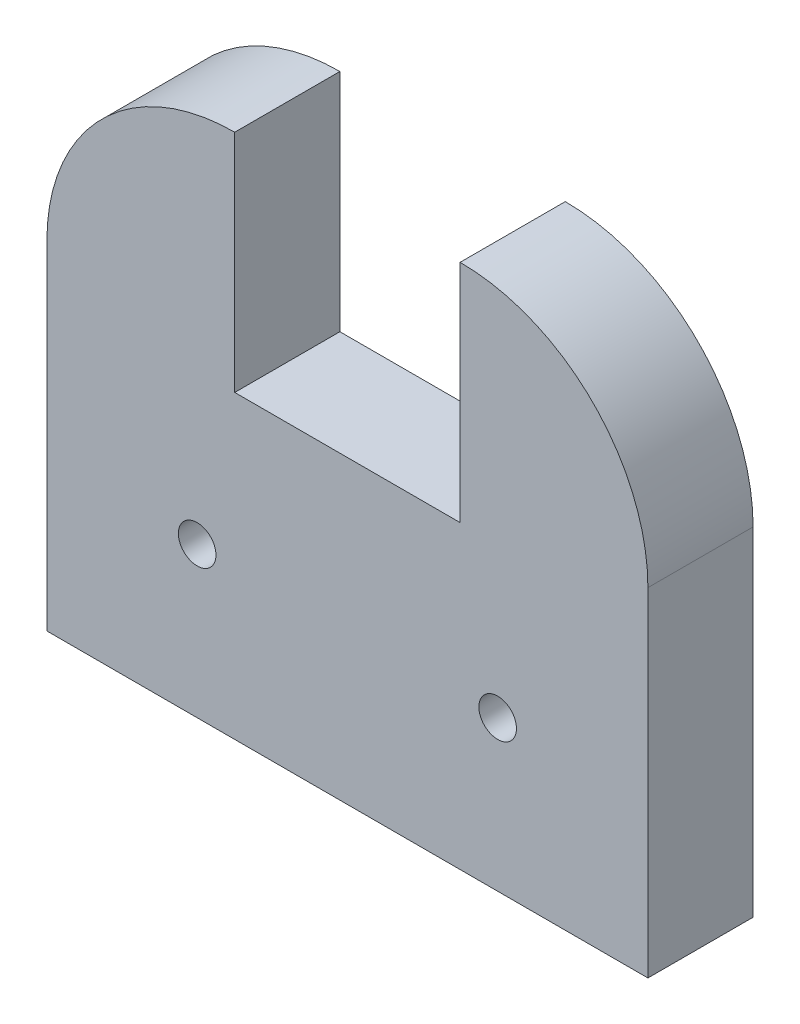
ISO-10303-21;
HEADER;
FILE_DESCRIPTION(('STEP AP214'),'2;1');
FILE_NAME('part.step','',(''),(''),'','','');
FILE_SCHEMA(('AUTOMOTIVE_DESIGN { 1 0 10303 214 1 1 1 1 }'));
ENDSEC;
DATA;
#1=APPLICATION_CONTEXT('core data for automotive mechanical design processes');
#2=APPLICATION_PROTOCOL_DEFINITION('international standard','automotive_design',2000,#1);
#3=PRODUCT_CONTEXT('',#1,'mechanical');
#4=PRODUCT('Part','Part','',(#3));
#5=PRODUCT_RELATED_PRODUCT_CATEGORY('part','',(#4));
#6=PRODUCT_DEFINITION_FORMATION('','',#4);
#7=PRODUCT_DEFINITION_CONTEXT('part definition',#1,'design');
#8=PRODUCT_DEFINITION('design','',#6,#7);
#9=PRODUCT_DEFINITION_SHAPE('','',#8);
#10=(LENGTH_UNIT() NAMED_UNIT(*) SI_UNIT(.MILLI.,.METRE.));
#11=(NAMED_UNIT(*) PLANE_ANGLE_UNIT() SI_UNIT($,.RADIAN.));
#12=(NAMED_UNIT(*) SI_UNIT($,.STERADIAN.) SOLID_ANGLE_UNIT());
#13=UNCERTAINTY_MEASURE_WITH_UNIT(LENGTH_MEASURE(1.E-05),#10,'distance_accuracy_value','');
#14=(GEOMETRIC_REPRESENTATION_CONTEXT(3) GLOBAL_UNCERTAINTY_ASSIGNED_CONTEXT((#13)) GLOBAL_UNIT_ASSIGNED_CONTEXT((#10,
#11,#12)) REPRESENTATION_CONTEXT('',''));
#15=CARTESIAN_POINT('',(0.,0.,0.));
#16=DIRECTION('',(0.,0.,1.));
#17=DIRECTION('',(1.,0.,0.));
#18=AXIS2_PLACEMENT_3D('',#15,#16,#17);
#19=CARTESIAN_POINT('',(-45.8724694390817,52.0606367004635,17.78));
#20=DIRECTION('',(1.,0.,0.));
#21=DIRECTION('',(0.,1.,0.));
#22=AXIS2_PLACEMENT_3D('',#19,#20,#21);
#23=PLANE('',#22);
#24=DIRECTION('',(0.,-1.,0.));
#25=VECTOR('',#24,1.);
#26=CARTESIAN_POINT('',(-45.8724694390817,52.0606367004635,17.78));
#27=LINE('',#26,#25);
#28=CARTESIAN_POINT('',(-45.8724694390817,20.3106367004635,17.78));
#29=VERTEX_POINT('',#28);
#30=CARTESIAN_POINT('',(-45.8724694390817,-36.8393632995365,17.78));
#31=VERTEX_POINT('',#30);
#32=EDGE_CURVE('E145',#29,#31,#27,.T.);
#33=ORIENTED_EDGE('',*,*,#32,.F.);
#34=DIRECTION('',(0.,0.,-1.));
#35=VECTOR('',#34,1.);
#36=CARTESIAN_POINT('',(-45.8724694390817,20.3106367004635,17.78));
#37=LINE('',#36,#35);
#38=CARTESIAN_POINT('',(-45.8724694390817,20.3106367004635,0.));
#39=VERTEX_POINT('',#38);
#40=EDGE_CURVE('E11',#29,#39,#37,.T.);
#41=ORIENTED_EDGE('',*,*,#40,.T.);
#42=DIRECTION('',(0.,-1.,0.));
#43=VECTOR('',#42,1.);
#44=CARTESIAN_POINT('',(-45.8724694390817,52.0606367004635,0.));
#45=LINE('',#44,#43);
#46=CARTESIAN_POINT('',(-45.8724694390817,-36.8393632995365,0.));
#47=VERTEX_POINT('',#46);
#48=EDGE_CURVE('E142',#39,#47,#45,.T.);
#49=ORIENTED_EDGE('',*,*,#48,.T.);
#50=DIRECTION('',(0.,0.,-1.));
#51=VECTOR('',#50,1.);
#52=CARTESIAN_POINT('',(-45.8724694390817,-36.8393632995365,17.78));
#53=LINE('',#52,#51);
#54=EDGE_CURVE('E159',#31,#47,#53,.T.);
#55=ORIENTED_EDGE('',*,*,#54,.F.);
#56=EDGE_LOOP('',(#33,#41,#49,#55));
#57=FACE_BOUND('',#56,.T.);
#58=ADVANCED_FACE('F31',(#57),#23,.F.);
#59=CARTESIAN_POINT('',(-45.8724694390817,-36.8393632995365,17.78));
#60=DIRECTION('',(0.,1.,0.));
#61=DIRECTION('',(0.,0.,1.));
#62=AXIS2_PLACEMENT_3D('',#59,#60,#61);
#63=PLANE('',#62);
#64=DIRECTION('',(1.,0.,0.));
#65=VECTOR('',#64,1.);
#66=CARTESIAN_POINT('',(-45.8724694390817,-36.8393632995365,0.));
#67=LINE('',#66,#65);
#68=CARTESIAN_POINT('',(55.7275305609183,-36.8393632995365,0.));
#69=VERTEX_POINT('',#68);
#70=EDGE_CURVE('E154',#47,#69,#67,.T.);
#71=ORIENTED_EDGE('',*,*,#70,.T.);
#72=DIRECTION('',(0.,0.,-1.));
#73=VECTOR('',#72,1.);
#74=CARTESIAN_POINT('',(55.7275305609183,-36.8393632995365,17.78));
#75=LINE('',#74,#73);
#76=CARTESIAN_POINT('',(55.7275305609183,-36.8393632995365,17.78));
#77=VERTEX_POINT('',#76);
#78=EDGE_CURVE('E152',#77,#69,#75,.T.);
#79=ORIENTED_EDGE('',*,*,#78,.F.);
#80=DIRECTION('',(1.,0.,0.));
#81=VECTOR('',#80,1.);
#82=CARTESIAN_POINT('',(-45.8724694390817,-36.8393632995365,17.78));
#83=LINE('',#82,#81);
#84=EDGE_CURVE('E147',#31,#77,#83,.T.);
#85=ORIENTED_EDGE('',*,*,#84,.F.);
#86=ORIENTED_EDGE('',*,*,#54,.T.);
#87=EDGE_LOOP('',(#71,#79,#85,#86));
#88=FACE_BOUND('',#87,.T.);
#89=ADVANCED_FACE('F187',(#88),#63,.F.);
#90=CARTESIAN_POINT('',(55.7275305609183,52.0606367004635,17.78));
#91=DIRECTION('',(-1.,0.,0.));
#92=DIRECTION('',(0.,-1.,0.));
#93=AXIS2_PLACEMENT_3D('',#90,#91,#92);
#94=PLANE('',#93);
#95=DIRECTION('',(0.,1.,0.));
#96=VECTOR('',#95,1.);
#97=CARTESIAN_POINT('',(55.7275305609183,52.0606367004635,0.));
#98=LINE('',#97,#96);
#99=CARTESIAN_POINT('',(55.7275305609183,20.3106367004635,0.));
#100=VERTEX_POINT('',#99);
#101=EDGE_CURVE('E148',#69,#100,#98,.T.);
#102=ORIENTED_EDGE('',*,*,#101,.T.);
#103=DIRECTION('',(0.,0.,-1.));
#104=VECTOR('',#103,1.);
#105=CARTESIAN_POINT('',(55.7275305609183,20.3106367004635,17.78));
#106=LINE('',#105,#104);
#107=CARTESIAN_POINT('',(55.7275305609183,20.3106367004635,17.78));
#108=VERTEX_POINT('',#107);
#109=EDGE_CURVE('E54',#100,#108,#106,.F.);
#110=ORIENTED_EDGE('',*,*,#109,.T.);
#111=DIRECTION('',(0.,1.,0.));
#112=VECTOR('',#111,1.);
#113=CARTESIAN_POINT('',(55.7275305609183,52.0606367004635,17.78));
#114=LINE('',#113,#112);
#115=EDGE_CURVE('E150',#77,#108,#114,.T.);
#116=ORIENTED_EDGE('',*,*,#115,.F.);
#117=ORIENTED_EDGE('',*,*,#78,.T.);
#118=EDGE_LOOP('',(#102,#110,#116,#117));
#119=FACE_BOUND('',#118,.T.);
#120=ADVANCED_FACE('F183',(#119),#94,.F.);
#121=CARTESIAN_POINT('',(-45.8724694390817,-36.8393632995365,17.78));
#122=DIRECTION('',(0.,0.,1.));
#123=DIRECTION('',(1.,0.,0.));
#124=AXIS2_PLACEMENT_3D('',#121,#122,#123);
#125=PLANE('',#124);
#126=DIRECTION('',(0.,-1.,0.));
#127=VECTOR('',#126,1.);
#128=CARTESIAN_POINT('',(-14.1224694390817,52.0606367004635,17.78));
#129=LINE('',#128,#127);
#130=CARTESIAN_POINT('',(-14.1224694390817,52.0606367004635,17.78));
#131=VERTEX_POINT('',#130);
#132=CARTESIAN_POINT('',(-14.1224694390817,13.9606367004635,17.78));
#133=VERTEX_POINT('',#132);
#134=EDGE_CURVE('E104',#131,#133,#129,.T.);
#135=ORIENTED_EDGE('',*,*,#134,.F.);
#136=CARTESIAN_POINT('',(-14.1224694390817,20.3106367004635,17.78));
#137=DIRECTION('',(0.,0.,1.));
#138=DIRECTION('',(1.,0.,0.));
#139=AXIS2_PLACEMENT_3D('',#136,#137,#138);
#140=CIRCLE('',#139,31.75);
#141=EDGE_CURVE('E46',#131,#29,#140,.T.);
#142=ORIENTED_EDGE('',*,*,#141,.T.);
#143=ORIENTED_EDGE('',*,*,#32,.T.);
#144=ORIENTED_EDGE('',*,*,#84,.T.);
#145=ORIENTED_EDGE('',*,*,#115,.T.);
#146=CARTESIAN_POINT('',(23.9775305609183,20.3106367004635,17.78));
#147=DIRECTION('',(0.,0.,1.));
#148=DIRECTION('',(1.,0.,0.));
#149=AXIS2_PLACEMENT_3D('',#146,#147,#148);
#150=CIRCLE('',#149,31.75);
#151=CARTESIAN_POINT('',(23.9775305609183,52.0606367004635,17.78));
#152=VERTEX_POINT('',#151);
#153=EDGE_CURVE('E39',#108,#152,#150,.T.);
#154=ORIENTED_EDGE('',*,*,#153,.T.);
#155=DIRECTION('',(0.,1.,0.));
#156=VECTOR('',#155,1.);
#157=CARTESIAN_POINT('',(23.9775305609183,52.0606367004635,17.78));
#158=LINE('',#157,#156);
#159=CARTESIAN_POINT('',(23.9775305609183,13.9606367004635,17.78));
#160=VERTEX_POINT('',#159);
#161=EDGE_CURVE('E123',#160,#152,#158,.T.);
#162=ORIENTED_EDGE('',*,*,#161,.F.);
#163=DIRECTION('',(1.,0.,0.));
#164=VECTOR('',#163,1.);
#165=CARTESIAN_POINT('',(-14.1224694390817,13.9606367004635,17.78));
#166=LINE('',#165,#164);
#167=EDGE_CURVE('E125',#133,#160,#166,.T.);
#168=ORIENTED_EDGE('',*,*,#167,.F.);
#169=EDGE_LOOP('',(#135,#142,#143,#144,#145,#154,#162,#168));
#170=FACE_BOUND('',#169,.T.);
#171=CARTESIAN_POINT('',(30.3275305609183,-11.4393632995365,17.78));
#172=DIRECTION('',(0.,0.,1.));
#173=DIRECTION('',(1.,0.,0.));
#174=AXIS2_PLACEMENT_3D('',#171,#172,#173);
#175=CIRCLE('',#174,3.175);
#176=CARTESIAN_POINT('',(33.5025305609183,-11.4393632995365,17.78));
#177=VERTEX_POINT('',#176);
#178=EDGE_CURVE('E131',#177,#177,#175,.T.);
#179=ORIENTED_EDGE('',*,*,#178,.F.);
#180=EDGE_LOOP('',(#179));
#181=FACE_BOUND('',#180,.T.);
#182=CARTESIAN_POINT('',(-20.4724694390817,-11.4393632995365,17.78));
#183=DIRECTION('',(0.,0.,1.));
#184=DIRECTION('',(1.,0.,0.));
#185=AXIS2_PLACEMENT_3D('',#182,#183,#184);
#186=CIRCLE('',#185,3.175);
#187=CARTESIAN_POINT('',(-17.2974694390817,-11.4393632995365,17.78));
#188=VERTEX_POINT('',#187);
#189=EDGE_CURVE('E136',#188,#188,#186,.T.);
#190=ORIENTED_EDGE('',*,*,#189,.F.);
#191=EDGE_LOOP('',(#190));
#192=FACE_BOUND('',#191,.T.);
#193=ADVANCED_FACE('F174',(#170,#181,#192),#125,.T.);
#194=CARTESIAN_POINT('',(-45.8724694390817,-36.8393632995365,0.));
#195=DIRECTION('',(0.,0.,1.));
#196=DIRECTION('',(1.,0.,0.));
#197=AXIS2_PLACEMENT_3D('',#194,#195,#196);
#198=PLANE('',#197);
#199=CARTESIAN_POINT('',(-14.1224694390817,20.3106367004635,0.));
#200=DIRECTION('',(0.,0.,1.));
#201=DIRECTION('',(1.,0.,0.));
#202=AXIS2_PLACEMENT_3D('',#199,#200,#201);
#203=CIRCLE('',#202,31.75);
#204=CARTESIAN_POINT('',(-14.1224694390817,52.0606367004635,0.));
#205=VERTEX_POINT('',#204);
#206=EDGE_CURVE('E121',#39,#205,#203,.F.);
#207=ORIENTED_EDGE('',*,*,#206,.T.);
#208=DIRECTION('',(0.,-1.,0.));
#209=VECTOR('',#208,1.);
#210=CARTESIAN_POINT('',(-14.1224694390817,52.0606367004635,0.));
#211=LINE('',#210,#209);
#212=CARTESIAN_POINT('',(-14.1224694390817,13.9606367004635,0.));
#213=VERTEX_POINT('',#212);
#214=EDGE_CURVE('E102',#205,#213,#211,.T.);
#215=ORIENTED_EDGE('',*,*,#214,.T.);
#216=DIRECTION('',(1.,0.,0.));
#217=VECTOR('',#216,1.);
#218=CARTESIAN_POINT('',(-14.1224694390817,13.9606367004635,0.));
#219=LINE('',#218,#217);
#220=CARTESIAN_POINT('',(23.9775305609183,13.9606367004635,0.));
#221=VERTEX_POINT('',#220);
#222=EDGE_CURVE('E112',#213,#221,#219,.T.);
#223=ORIENTED_EDGE('',*,*,#222,.T.);
#224=DIRECTION('',(0.,1.,0.));
#225=VECTOR('',#224,1.);
#226=CARTESIAN_POINT('',(23.9775305609183,52.0606367004635,0.));
#227=LINE('',#226,#225);
#228=CARTESIAN_POINT('',(23.9775305609183,52.0606367004635,0.));
#229=VERTEX_POINT('',#228);
#230=EDGE_CURVE('E109',#221,#229,#227,.T.);
#231=ORIENTED_EDGE('',*,*,#230,.T.);
#232=CARTESIAN_POINT('',(23.9775305609183,20.3106367004635,0.));
#233=DIRECTION('',(0.,0.,1.));
#234=DIRECTION('',(1.,0.,0.));
#235=AXIS2_PLACEMENT_3D('',#232,#233,#234);
#236=CIRCLE('',#235,31.75);
#237=EDGE_CURVE('E167',#229,#100,#236,.F.);
#238=ORIENTED_EDGE('',*,*,#237,.T.);
#239=ORIENTED_EDGE('',*,*,#101,.F.);
#240=ORIENTED_EDGE('',*,*,#70,.F.);
#241=ORIENTED_EDGE('',*,*,#48,.F.);
#242=EDGE_LOOP('',(#207,#215,#223,#231,#238,#239,#240,#241));
#243=FACE_BOUND('',#242,.T.);
#244=CARTESIAN_POINT('',(30.3275305609183,-11.4393632995365,0.));
#245=DIRECTION('',(0.,0.,1.));
#246=DIRECTION('',(1.,0.,0.));
#247=AXIS2_PLACEMENT_3D('',#244,#245,#246);
#248=CIRCLE('',#247,3.175);
#249=CARTESIAN_POINT('',(33.5025305609183,-11.4393632995365,0.));
#250=VERTEX_POINT('',#249);
#251=EDGE_CURVE('E133',#250,#250,#248,.T.);
#252=ORIENTED_EDGE('',*,*,#251,.T.);
#253=EDGE_LOOP('',(#252));
#254=FACE_BOUND('',#253,.T.);
#255=CARTESIAN_POINT('',(-20.4724694390817,-11.4393632995365,0.));
#256=DIRECTION('',(0.,0.,1.));
#257=DIRECTION('',(1.,0.,0.));
#258=AXIS2_PLACEMENT_3D('',#255,#256,#257);
#259=CIRCLE('',#258,3.175);
#260=CARTESIAN_POINT('',(-17.2974694390817,-11.4393632995365,0.));
#261=VERTEX_POINT('',#260);
#262=EDGE_CURVE('E139',#261,#261,#259,.T.);
#263=ORIENTED_EDGE('',*,*,#262,.T.);
#264=EDGE_LOOP('',(#263));
#265=FACE_BOUND('',#264,.T.);
#266=ADVANCED_FACE('F118',(#243,#254,#265),#198,.F.);
#267=CARTESIAN_POINT('',(-20.4724694390817,-11.4393632995365,0.));
#268=DIRECTION('',(0.,0.,1.));
#269=DIRECTION('',(1.,0.,0.));
#270=AXIS2_PLACEMENT_3D('',#267,#268,#269);
#271=CYLINDRICAL_SURFACE('',#270,3.175);
#272=ORIENTED_EDGE('',*,*,#262,.F.);
#273=EDGE_LOOP('',(#272));
#274=FACE_BOUND('',#273,.T.);
#275=ORIENTED_EDGE('',*,*,#189,.T.);
#276=EDGE_LOOP('',(#275));
#277=FACE_BOUND('',#276,.T.);
#278=ADVANCED_FACE('F210',(#274,#277),#271,.F.);
#279=CARTESIAN_POINT('',(30.3275305609183,-11.4393632995365,0.));
#280=DIRECTION('',(0.,0.,1.));
#281=DIRECTION('',(1.,0.,0.));
#282=AXIS2_PLACEMENT_3D('',#279,#280,#281);
#283=CYLINDRICAL_SURFACE('',#282,3.175);
#284=ORIENTED_EDGE('',*,*,#251,.F.);
#285=EDGE_LOOP('',(#284));
#286=FACE_BOUND('',#285,.T.);
#287=ORIENTED_EDGE('',*,*,#178,.T.);
#288=EDGE_LOOP('',(#287));
#289=FACE_BOUND('',#288,.T.);
#290=ADVANCED_FACE('F198',(#286,#289),#283,.F.);
#291=CARTESIAN_POINT('',(23.9775305609183,20.3106367004635,17.78));
#292=DIRECTION('',(0.,0.,-1.));
#293=DIRECTION('',(-1.,0.,0.));
#294=AXIS2_PLACEMENT_3D('',#291,#292,#293);
#295=CYLINDRICAL_SURFACE('',#294,31.75);
#296=ORIENTED_EDGE('',*,*,#153,.F.);
#297=ORIENTED_EDGE('',*,*,#109,.F.);
#298=ORIENTED_EDGE('',*,*,#237,.F.);
#299=DIRECTION('',(0.,0.,-1.));
#300=VECTOR('',#299,1.);
#301=CARTESIAN_POINT('',(23.9775305609183,52.0606367004635,17.78));
#302=LINE('',#301,#300);
#303=EDGE_CURVE('E164',#152,#229,#302,.T.);
#304=ORIENTED_EDGE('',*,*,#303,.F.);
#305=EDGE_LOOP('',(#296,#297,#298,#304));
#306=FACE_BOUND('',#305,.T.);
#307=ADVANCED_FACE('F178',(#306),#295,.T.);
#308=CARTESIAN_POINT('',(-14.1224694390817,20.3106367004635,17.78));
#309=DIRECTION('',(0.,0.,-1.));
#310=DIRECTION('',(-1.,0.,0.));
#311=AXIS2_PLACEMENT_3D('',#308,#309,#310);
#312=CYLINDRICAL_SURFACE('',#311,31.75);
#313=ORIENTED_EDGE('',*,*,#141,.F.);
#314=DIRECTION('',(0.,0.,-1.));
#315=VECTOR('',#314,1.);
#316=CARTESIAN_POINT('',(-14.1224694390817,52.0606367004635,17.78));
#317=LINE('',#316,#315);
#318=EDGE_CURVE('E162',#205,#131,#317,.F.);
#319=ORIENTED_EDGE('',*,*,#318,.F.);
#320=ORIENTED_EDGE('',*,*,#206,.F.);
#321=ORIENTED_EDGE('',*,*,#40,.F.);
#322=EDGE_LOOP('',(#313,#319,#320,#321));
#323=FACE_BOUND('',#322,.T.);
#324=ADVANCED_FACE('F33',(#323),#312,.T.);
#325=CARTESIAN_POINT('',(-14.1224694390817,52.0606367004635,0.));
#326=DIRECTION('',(-1.,0.,0.));
#327=DIRECTION('',(0.,-1.,0.));
#328=AXIS2_PLACEMENT_3D('',#325,#326,#327);
#329=PLANE('',#328);
#330=ORIENTED_EDGE('',*,*,#134,.T.);
#331=DIRECTION('',(0.,0.,1.));
#332=VECTOR('',#331,1.);
#333=CARTESIAN_POINT('',(-14.1224694390817,13.9606367004635,0.));
#334=LINE('',#333,#332);
#335=EDGE_CURVE('E98',#213,#133,#334,.T.);
#336=ORIENTED_EDGE('',*,*,#335,.F.);
#337=ORIENTED_EDGE('',*,*,#214,.F.);
#338=ORIENTED_EDGE('',*,*,#318,.T.);
#339=EDGE_LOOP('',(#330,#336,#337,#338));
#340=FACE_BOUND('',#339,.T.);
#341=ADVANCED_FACE('F100',(#340),#329,.F.);
#342=CARTESIAN_POINT('',(23.9775305609183,52.0606367004635,0.));
#343=DIRECTION('',(1.,0.,0.));
#344=DIRECTION('',(0.,1.,0.));
#345=AXIS2_PLACEMENT_3D('',#342,#343,#344);
#346=PLANE('',#345);
#347=ORIENTED_EDGE('',*,*,#161,.T.);
#348=ORIENTED_EDGE('',*,*,#303,.T.);
#349=ORIENTED_EDGE('',*,*,#230,.F.);
#350=DIRECTION('',(0.,0.,1.));
#351=VECTOR('',#350,1.);
#352=CARTESIAN_POINT('',(23.9775305609183,13.9606367004635,0.));
#353=LINE('',#352,#351);
#354=EDGE_CURVE('E108',#221,#160,#353,.T.);
#355=ORIENTED_EDGE('',*,*,#354,.T.);
#356=EDGE_LOOP('',(#347,#348,#349,#355));
#357=FACE_BOUND('',#356,.T.);
#358=ADVANCED_FACE('F180',(#357),#346,.F.);
#359=CARTESIAN_POINT('',(-14.1224694390817,13.9606367004635,0.));
#360=DIRECTION('',(0.,-1.,0.));
#361=DIRECTION('',(0.,0.,-1.));
#362=AXIS2_PLACEMENT_3D('',#359,#360,#361);
#363=PLANE('',#362);
#364=ORIENTED_EDGE('',*,*,#167,.T.);
#365=ORIENTED_EDGE('',*,*,#354,.F.);
#366=ORIENTED_EDGE('',*,*,#222,.F.);
#367=ORIENTED_EDGE('',*,*,#335,.T.);
#368=EDGE_LOOP('',(#364,#365,#366,#367));
#369=FACE_BOUND('',#368,.T.);
#370=ADVANCED_FACE('F113',(#369),#363,.F.);
#371=CLOSED_SHELL('',(#58,#89,#120,#193,#266,#278,#290,#307,#324,#341,#358,#370));
#372=MANIFOLD_SOLID_BREP('B2',#371);
#373=ADVANCED_BREP_SHAPE_REPRESENTATION('',(#18,#372),#14);
#374=SHAPE_DEFINITION_REPRESENTATION(#9,#373);
ENDSEC;
END-ISO-10303-21;
